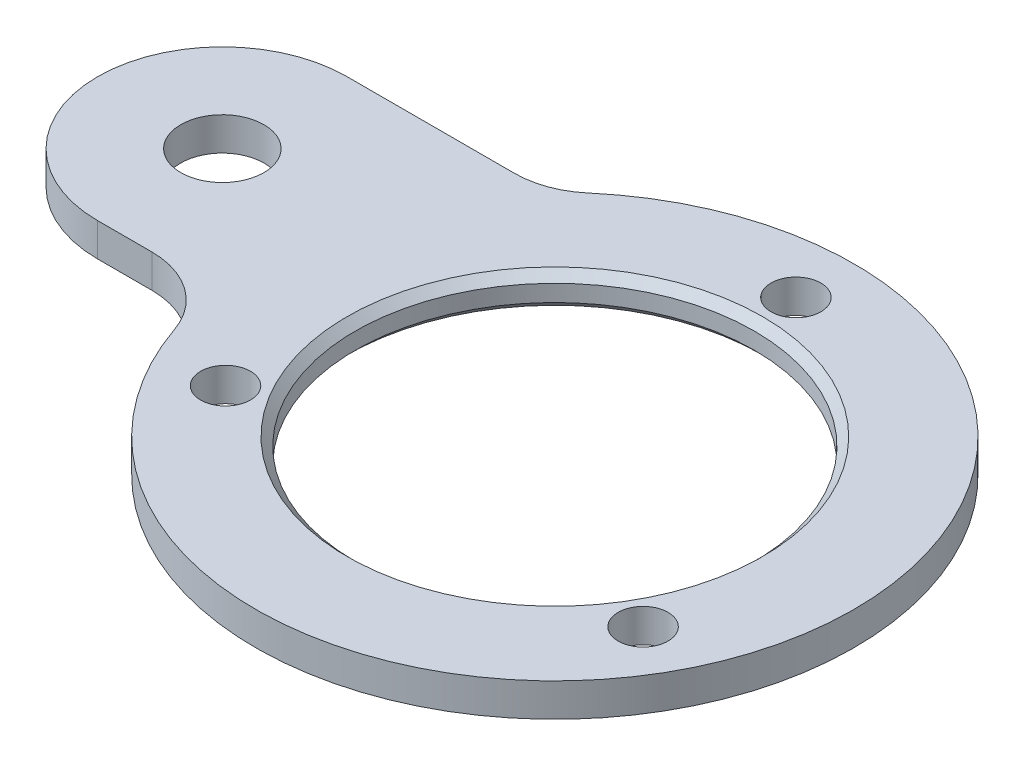
ISO-10303-21;
HEADER;
FILE_DESCRIPTION(('STEP AP214'),'2;1');
FILE_NAME('part.step','',(''),(''),'','','');
FILE_SCHEMA(('AUTOMOTIVE_DESIGN { 1 0 10303 214 1 1 1 1 }'));
ENDSEC;
DATA;
#1=APPLICATION_CONTEXT('core data for automotive mechanical design processes');
#2=APPLICATION_PROTOCOL_DEFINITION('international standard','automotive_design',2000,#1);
#3=PRODUCT_CONTEXT('',#1,'mechanical');
#4=PRODUCT('Part','Part','',(#3));
#5=PRODUCT_RELATED_PRODUCT_CATEGORY('part','',(#4));
#6=PRODUCT_DEFINITION_FORMATION('','',#4);
#7=PRODUCT_DEFINITION_CONTEXT('part definition',#1,'design');
#8=PRODUCT_DEFINITION('design','',#6,#7);
#9=PRODUCT_DEFINITION_SHAPE('','',#8);
#10=(LENGTH_UNIT() NAMED_UNIT(*) SI_UNIT(.MILLI.,.METRE.));
#11=(NAMED_UNIT(*) PLANE_ANGLE_UNIT() SI_UNIT($,.RADIAN.));
#12=(NAMED_UNIT(*) SI_UNIT($,.STERADIAN.) SOLID_ANGLE_UNIT());
#13=UNCERTAINTY_MEASURE_WITH_UNIT(LENGTH_MEASURE(1.E-05),#10,'distance_accuracy_value','');
#14=(GEOMETRIC_REPRESENTATION_CONTEXT(3) GLOBAL_UNCERTAINTY_ASSIGNED_CONTEXT((#13)) GLOBAL_UNIT_ASSIGNED_CONTEXT((#10,
#11,#12)) REPRESENTATION_CONTEXT('',''));
#15=CARTESIAN_POINT('',(0.,0.,0.));
#16=DIRECTION('',(0.,0.,1.));
#17=DIRECTION('',(1.,0.,0.));
#18=AXIS2_PLACEMENT_3D('',#15,#16,#17);
#19=CARTESIAN_POINT('',(-14.9248115565993,2.,-17.5));
#20=DIRECTION('',(0.,-1.,0.));
#21=DIRECTION('',(0.,0.,-1.));
#22=AXIS2_PLACEMENT_3D('',#19,#20,#21);
#23=PLANE('',#22);
#24=CARTESIAN_POINT('',(0.,2.,0.));
#25=DIRECTION('',(0.,-1.,0.));
#26=DIRECTION('',(0.,0.,-1.));
#27=AXIS2_PLACEMENT_3D('',#24,#25,#26);
#28=CIRCLE('',#27,12.5);
#29=CARTESIAN_POINT('',(0.,2.,-12.5));
#30=VERTEX_POINT('',#29);
#31=EDGE_CURVE('E39',#30,#30,#28,.T.);
#32=ORIENTED_EDGE('',*,*,#31,.T.);
#33=EDGE_LOOP('',(#32));
#34=FACE_BOUND('',#33,.T.);
#35=CARTESIAN_POINT('',(0.,2.,-14.5));
#36=DIRECTION('',(0.,1.,0.));
#37=DIRECTION('',(0.,0.,1.));
#38=AXIS2_PLACEMENT_3D('',#35,#36,#37);
#39=CIRCLE('',#38,1.5);
#40=CARTESIAN_POINT('',(0.,2.,-13.));
#41=VERTEX_POINT('',#40);
#42=EDGE_CURVE('E192',#41,#41,#39,.T.);
#43=ORIENTED_EDGE('',*,*,#42,.F.);
#44=EDGE_LOOP('',(#43));
#45=FACE_BOUND('',#44,.T.);
#46=CARTESIAN_POINT('',(-12.5573683548744,2.,7.24999999999989));
#47=DIRECTION('',(0.,1.,0.));
#48=DIRECTION('',(0.,0.,1.));
#49=AXIS2_PLACEMENT_3D('',#46,#47,#48);
#50=CIRCLE('',#49,1.5);
#51=CARTESIAN_POINT('',(-12.5573683548744,2.,8.74999999999989));
#52=VERTEX_POINT('',#51);
#53=EDGE_CURVE('E120',#52,#52,#50,.T.);
#54=ORIENTED_EDGE('',*,*,#53,.F.);
#55=EDGE_LOOP('',(#54));
#56=FACE_BOUND('',#55,.T.);
#57=CARTESIAN_POINT('',(-14.9248115565993,2.,-17.5));
#58=DIRECTION('',(0.,-1.,0.));
#59=DIRECTION('',(0.,0.,-1.));
#60=AXIS2_PLACEMENT_3D('',#57,#58,#59);
#61=CIRCLE('',#60,5.);
#62=CARTESIAN_POINT('',(-11.6802873051647,2.,-13.695652173913));
#63=VERTEX_POINT('',#62);
#64=CARTESIAN_POINT('',(-14.9248115565993,2.,-12.5));
#65=VERTEX_POINT('',#64);
#66=EDGE_CURVE('E127',#63,#65,#61,.T.);
#67=ORIENTED_EDGE('',*,*,#66,.T.);
#68=DIRECTION('',(-1.,0.,0.));
#69=VECTOR('',#68,1.);
#70=CARTESIAN_POINT('',(-25.,2.,-12.5));
#71=LINE('',#70,#69);
#72=CARTESIAN_POINT('',(-25.,2.,-12.5));
#73=VERTEX_POINT('',#72);
#74=EDGE_CURVE('E85',#65,#73,#71,.T.);
#75=ORIENTED_EDGE('',*,*,#74,.T.);
#76=CARTESIAN_POINT('',(-25.,2.,-5.));
#77=DIRECTION('',(0.,1.,0.));
#78=DIRECTION('',(0.,0.,-1.));
#79=AXIS2_PLACEMENT_3D('',#76,#77,#78);
#80=CIRCLE('',#79,7.5);
#81=CARTESIAN_POINT('',(-25.,2.,2.5));
#82=VERTEX_POINT('',#81);
#83=EDGE_CURVE('E98',#73,#82,#80,.T.);
#84=ORIENTED_EDGE('',*,*,#83,.T.);
#85=DIRECTION('',(1.,0.,0.));
#86=VECTOR('',#85,1.);
#87=CARTESIAN_POINT('',(-25.,2.,2.5));
#88=LINE('',#87,#86);
#89=CARTESIAN_POINT('',(-21.7428149051589,2.,2.5));
#90=VERTEX_POINT('',#89);
#91=EDGE_CURVE('E92',#82,#90,#88,.T.);
#92=ORIENTED_EDGE('',*,*,#91,.T.);
#93=CARTESIAN_POINT('',(-21.7428149051589,2.,7.5));
#94=DIRECTION('',(0.,-1.,0.));
#95=DIRECTION('',(0.,0.,1.));
#96=AXIS2_PLACEMENT_3D('',#93,#94,#95);
#97=CIRCLE('',#96,5.);
#98=CARTESIAN_POINT('',(-17.0161160127331,2.,5.86956521739131));
#99=VERTEX_POINT('',#98);
#100=EDGE_CURVE('E96',#90,#99,#97,.T.);
#101=ORIENTED_EDGE('',*,*,#100,.T.);
#102=CARTESIAN_POINT('',(0.,2.,0.));
#103=DIRECTION('',(0.,1.,0.));
#104=DIRECTION('',(0.,0.,1.));
#105=AXIS2_PLACEMENT_3D('',#102,#103,#104);
#106=CIRCLE('',#105,18.);
#107=EDGE_CURVE('E47',#99,#63,#106,.T.);
#108=ORIENTED_EDGE('',*,*,#107,.T.);
#109=EDGE_LOOP('',(#67,#75,#84,#92,#101,#108));
#110=FACE_BOUND('',#109,.T.);
#111=CARTESIAN_POINT('',(12.5573683548744,2.,7.24999999999994));
#112=DIRECTION('',(0.,1.,0.));
#113=DIRECTION('',(0.,0.,1.));
#114=AXIS2_PLACEMENT_3D('',#111,#112,#113);
#115=CIRCLE('',#114,1.4999999999999);
#116=CARTESIAN_POINT('',(12.5573683548744,2.,8.74999999999984));
#117=VERTEX_POINT('',#116);
#118=EDGE_CURVE('E196',#117,#117,#115,.T.);
#119=ORIENTED_EDGE('',*,*,#118,.F.);
#120=EDGE_LOOP('',(#119));
#121=FACE_BOUND('',#120,.T.);
#122=CARTESIAN_POINT('',(-25.,2.,-5.));
#123=DIRECTION('',(0.,1.,0.));
#124=DIRECTION('',(0.,0.,-1.));
#125=AXIS2_PLACEMENT_3D('',#122,#123,#124);
#126=CIRCLE('',#125,2.5);
#127=CARTESIAN_POINT('',(-25.,2.,-7.5));
#128=VERTEX_POINT('',#127);
#129=EDGE_CURVE('E187',#128,#128,#126,.T.);
#130=ORIENTED_EDGE('',*,*,#129,.F.);
#131=EDGE_LOOP('',(#130));
#132=FACE_BOUND('',#131,.T.);
#133=ADVANCED_FACE('F30',(#34,#45,#56,#110,#121,#132),#23,.F.);
#134=CARTESIAN_POINT('',(-14.9248115565993,0.,-17.5));
#135=DIRECTION('',(0.,-1.,0.));
#136=DIRECTION('',(0.,0.,-1.));
#137=AXIS2_PLACEMENT_3D('',#134,#135,#136);
#138=PLANE('',#137);
#139=CARTESIAN_POINT('',(0.,0.,0.));
#140=DIRECTION('',(0.,-1.,0.));
#141=DIRECTION('',(0.,0.,-1.));
#142=AXIS2_PLACEMENT_3D('',#139,#140,#141);
#143=CIRCLE('',#142,12.5);
#144=CARTESIAN_POINT('',(0.,0.,-12.5));
#145=VERTEX_POINT('',#144);
#146=EDGE_CURVE('E11',#145,#145,#143,.F.);
#147=ORIENTED_EDGE('',*,*,#146,.T.);
#148=EDGE_LOOP('',(#147));
#149=FACE_BOUND('',#148,.T.);
#150=CARTESIAN_POINT('',(0.,0.,-14.5));
#151=DIRECTION('',(0.,1.,0.));
#152=DIRECTION('',(0.,0.,1.));
#153=AXIS2_PLACEMENT_3D('',#150,#151,#152);
#154=CIRCLE('',#153,1.5);
#155=CARTESIAN_POINT('',(0.,0.,-13.));
#156=VERTEX_POINT('',#155);
#157=EDGE_CURVE('E172',#156,#156,#154,.T.);
#158=ORIENTED_EDGE('',*,*,#157,.T.);
#159=EDGE_LOOP('',(#158));
#160=FACE_BOUND('',#159,.T.);
#161=CARTESIAN_POINT('',(-12.5573683548744,0.,7.24999999999989));
#162=DIRECTION('',(0.,1.,0.));
#163=DIRECTION('',(0.,0.,1.));
#164=AXIS2_PLACEMENT_3D('',#161,#162,#163);
#165=CIRCLE('',#164,1.5);
#166=CARTESIAN_POINT('',(-12.5573683548744,0.,8.74999999999989));
#167=VERTEX_POINT('',#166);
#168=EDGE_CURVE('E176',#167,#167,#165,.T.);
#169=ORIENTED_EDGE('',*,*,#168,.T.);
#170=EDGE_LOOP('',(#169));
#171=FACE_BOUND('',#170,.T.);
#172=CARTESIAN_POINT('',(-14.9248115565993,0.,-17.5));
#173=DIRECTION('',(0.,-1.,0.));
#174=DIRECTION('',(0.,0.,-1.));
#175=AXIS2_PLACEMENT_3D('',#172,#173,#174);
#176=CIRCLE('',#175,5.);
#177=CARTESIAN_POINT('',(-11.6802873051647,0.,-13.695652173913));
#178=VERTEX_POINT('',#177);
#179=CARTESIAN_POINT('',(-14.9248115565993,0.,-12.5));
#180=VERTEX_POINT('',#179);
#181=EDGE_CURVE('E116',#178,#180,#176,.T.);
#182=ORIENTED_EDGE('',*,*,#181,.F.);
#183=CARTESIAN_POINT('',(0.,0.,0.));
#184=DIRECTION('',(0.,1.,0.));
#185=DIRECTION('',(0.,0.,1.));
#186=AXIS2_PLACEMENT_3D('',#183,#184,#185);
#187=CIRCLE('',#186,18.);
#188=CARTESIAN_POINT('',(-17.0161160127331,0.,5.86956521739131));
#189=VERTEX_POINT('',#188);
#190=EDGE_CURVE('E76',#189,#178,#187,.T.);
#191=ORIENTED_EDGE('',*,*,#190,.F.);
#192=CARTESIAN_POINT('',(-21.7428149051589,0.,7.5));
#193=DIRECTION('',(0.,-1.,0.));
#194=DIRECTION('',(0.,0.,1.));
#195=AXIS2_PLACEMENT_3D('',#192,#193,#194);
#196=CIRCLE('',#195,5.);
#197=CARTESIAN_POINT('',(-21.7428149051589,0.,2.5));
#198=VERTEX_POINT('',#197);
#199=EDGE_CURVE('E70',#198,#189,#196,.T.);
#200=ORIENTED_EDGE('',*,*,#199,.F.);
#201=DIRECTION('',(1.,0.,0.));
#202=VECTOR('',#201,1.);
#203=CARTESIAN_POINT('',(-25.,0.,2.5));
#204=LINE('',#203,#202);
#205=CARTESIAN_POINT('',(-25.,0.,2.5));
#206=VERTEX_POINT('',#205);
#207=EDGE_CURVE('E106',#206,#198,#204,.T.);
#208=ORIENTED_EDGE('',*,*,#207,.F.);
#209=CARTESIAN_POINT('',(-25.,0.,-5.));
#210=DIRECTION('',(0.,1.,0.));
#211=DIRECTION('',(0.,0.,-1.));
#212=AXIS2_PLACEMENT_3D('',#209,#210,#211);
#213=CIRCLE('',#212,7.5);
#214=CARTESIAN_POINT('',(-25.,0.,-12.5));
#215=VERTEX_POINT('',#214);
#216=EDGE_CURVE('E122',#215,#206,#213,.T.);
#217=ORIENTED_EDGE('',*,*,#216,.F.);
#218=DIRECTION('',(-1.,0.,0.));
#219=VECTOR('',#218,1.);
#220=CARTESIAN_POINT('',(-25.,0.,-12.5));
#221=LINE('',#220,#219);
#222=EDGE_CURVE('E119',#180,#215,#221,.T.);
#223=ORIENTED_EDGE('',*,*,#222,.F.);
#224=EDGE_LOOP('',(#182,#191,#200,#208,#217,#223));
#225=FACE_BOUND('',#224,.T.);
#226=CARTESIAN_POINT('',(12.5573683548744,0.,7.24999999999994));
#227=DIRECTION('',(0.,1.,0.));
#228=DIRECTION('',(0.,0.,1.));
#229=AXIS2_PLACEMENT_3D('',#226,#227,#228);
#230=CIRCLE('',#229,1.4999999999999);
#231=CARTESIAN_POINT('',(12.5573683548744,0.,8.74999999999984));
#232=VERTEX_POINT('',#231);
#233=EDGE_CURVE('E182',#232,#232,#230,.T.);
#234=ORIENTED_EDGE('',*,*,#233,.T.);
#235=EDGE_LOOP('',(#234));
#236=FACE_BOUND('',#235,.T.);
#237=CARTESIAN_POINT('',(-25.,0.,-5.));
#238=DIRECTION('',(0.,1.,0.));
#239=DIRECTION('',(0.,0.,-1.));
#240=AXIS2_PLACEMENT_3D('',#237,#238,#239);
#241=CIRCLE('',#240,2.5);
#242=CARTESIAN_POINT('',(-25.,0.,-7.5));
#243=VERTEX_POINT('',#242);
#244=EDGE_CURVE('E185',#243,#243,#241,.T.);
#245=ORIENTED_EDGE('',*,*,#244,.T.);
#246=EDGE_LOOP('',(#245));
#247=FACE_BOUND('',#246,.T.);
#248=ADVANCED_FACE('F164',(#149,#160,#171,#225,#236,#247),#138,.T.);
#249=CARTESIAN_POINT('',(-14.9248115565993,2.,-17.5));
#250=DIRECTION('',(0.,-1.,0.));
#251=DIRECTION('',(0.,0.,-1.));
#252=AXIS2_PLACEMENT_3D('',#249,#250,#251);
#253=CYLINDRICAL_SURFACE('',#252,5.);
#254=ORIENTED_EDGE('',*,*,#181,.T.);
#255=DIRECTION('',(0.,-1.,0.));
#256=VECTOR('',#255,1.);
#257=CARTESIAN_POINT('',(-14.9248115565993,2.,-12.5));
#258=LINE('',#257,#256);
#259=EDGE_CURVE('E134',#65,#180,#258,.T.);
#260=ORIENTED_EDGE('',*,*,#259,.F.);
#261=ORIENTED_EDGE('',*,*,#66,.F.);
#262=DIRECTION('',(0.,-1.,0.));
#263=VECTOR('',#262,1.);
#264=CARTESIAN_POINT('',(-11.6802873051647,2.,-13.695652173913));
#265=LINE('',#264,#263);
#266=EDGE_CURVE('E112',#63,#178,#265,.T.);
#267=ORIENTED_EDGE('',*,*,#266,.T.);
#268=EDGE_LOOP('',(#254,#260,#261,#267));
#269=FACE_BOUND('',#268,.T.);
#270=ADVANCED_FACE('F167',(#269),#253,.F.);
#271=CARTESIAN_POINT('',(-25.,2.,-12.5));
#272=DIRECTION('',(0.,0.,1.));
#273=DIRECTION('',(1.,0.,0.));
#274=AXIS2_PLACEMENT_3D('',#271,#272,#273);
#275=PLANE('',#274);
#276=ORIENTED_EDGE('',*,*,#222,.T.);
#277=DIRECTION('',(0.,-1.,0.));
#278=VECTOR('',#277,1.);
#279=CARTESIAN_POINT('',(-25.,2.,-12.5));
#280=LINE('',#279,#278);
#281=EDGE_CURVE('E131',#73,#215,#280,.T.);
#282=ORIENTED_EDGE('',*,*,#281,.F.);
#283=ORIENTED_EDGE('',*,*,#74,.F.);
#284=ORIENTED_EDGE('',*,*,#259,.T.);
#285=EDGE_LOOP('',(#276,#282,#283,#284));
#286=FACE_BOUND('',#285,.T.);
#287=ADVANCED_FACE('F206',(#286),#275,.F.);
#288=CARTESIAN_POINT('',(-25.,2.,-5.));
#289=DIRECTION('',(0.,-1.,0.));
#290=DIRECTION('',(0.,0.,-1.));
#291=AXIS2_PLACEMENT_3D('',#288,#289,#290);
#292=CYLINDRICAL_SURFACE('',#291,7.5);
#293=ORIENTED_EDGE('',*,*,#216,.T.);
#294=DIRECTION('',(0.,-1.,0.));
#295=VECTOR('',#294,1.);
#296=CARTESIAN_POINT('',(-25.,2.,2.5));
#297=LINE('',#296,#295);
#298=EDGE_CURVE('E107',#82,#206,#297,.T.);
#299=ORIENTED_EDGE('',*,*,#298,.F.);
#300=ORIENTED_EDGE('',*,*,#83,.F.);
#301=ORIENTED_EDGE('',*,*,#281,.T.);
#302=EDGE_LOOP('',(#293,#299,#300,#301));
#303=FACE_BOUND('',#302,.T.);
#304=ADVANCED_FACE('F209',(#303),#292,.T.);
#305=CARTESIAN_POINT('',(-25.,2.,2.5));
#306=DIRECTION('',(0.,0.,-1.));
#307=DIRECTION('',(-1.,0.,0.));
#308=AXIS2_PLACEMENT_3D('',#305,#306,#307);
#309=PLANE('',#308);
#310=ORIENTED_EDGE('',*,*,#207,.T.);
#311=DIRECTION('',(0.,-1.,0.));
#312=VECTOR('',#311,1.);
#313=CARTESIAN_POINT('',(-21.7428149051589,2.,2.5));
#314=LINE('',#313,#312);
#315=EDGE_CURVE('E103',#90,#198,#314,.T.);
#316=ORIENTED_EDGE('',*,*,#315,.F.);
#317=ORIENTED_EDGE('',*,*,#91,.F.);
#318=ORIENTED_EDGE('',*,*,#298,.T.);
#319=EDGE_LOOP('',(#310,#316,#317,#318));
#320=FACE_BOUND('',#319,.T.);
#321=ADVANCED_FACE('F104',(#320),#309,.F.);
#322=CARTESIAN_POINT('',(-21.7428149051589,2.,7.5));
#323=DIRECTION('',(0.,-1.,0.));
#324=DIRECTION('',(0.,0.,-1.));
#325=AXIS2_PLACEMENT_3D('',#322,#323,#324);
#326=CYLINDRICAL_SURFACE('',#325,5.);
#327=ORIENTED_EDGE('',*,*,#199,.T.);
#328=DIRECTION('',(0.,-1.,0.));
#329=VECTOR('',#328,1.);
#330=CARTESIAN_POINT('',(-17.0161160127331,2.,5.86956521739131));
#331=LINE('',#330,#329);
#332=EDGE_CURVE('E108',#99,#189,#331,.T.);
#333=ORIENTED_EDGE('',*,*,#332,.F.);
#334=ORIENTED_EDGE('',*,*,#100,.F.);
#335=ORIENTED_EDGE('',*,*,#315,.T.);
#336=EDGE_LOOP('',(#327,#333,#334,#335));
#337=FACE_BOUND('',#336,.T.);
#338=ADVANCED_FACE('F110',(#337),#326,.F.);
#339=CARTESIAN_POINT('',(0.,2.,0.));
#340=DIRECTION('',(0.,-1.,0.));
#341=DIRECTION('',(0.,0.,-1.));
#342=AXIS2_PLACEMENT_3D('',#339,#340,#341);
#343=CYLINDRICAL_SURFACE('',#342,18.);
#344=ORIENTED_EDGE('',*,*,#190,.T.);
#345=ORIENTED_EDGE('',*,*,#266,.F.);
#346=ORIENTED_EDGE('',*,*,#107,.F.);
#347=ORIENTED_EDGE('',*,*,#332,.T.);
#348=EDGE_LOOP('',(#344,#345,#346,#347));
#349=FACE_BOUND('',#348,.T.);
#350=ADVANCED_FACE('F156',(#349),#343,.T.);
#351=CARTESIAN_POINT('',(0.,2.,0.));
#352=DIRECTION('',(0.,-1.,0.));
#353=DIRECTION('',(0.,0.,-1.));
#354=AXIS2_PLACEMENT_3D('',#351,#352,#353);
#355=CYLINDRICAL_SURFACE('',#354,12.);
#356=CARTESIAN_POINT('',(0.,1.5,0.));
#357=DIRECTION('',(0.,-1.,0.));
#358=DIRECTION('',(0.,0.,-1.));
#359=AXIS2_PLACEMENT_3D('',#356,#357,#358);
#360=CIRCLE('',#359,12.);
#361=CARTESIAN_POINT('',(0.,1.5,-12.));
#362=VERTEX_POINT('',#361);
#363=EDGE_CURVE('E139',#362,#362,#360,.F.);
#364=ORIENTED_EDGE('',*,*,#363,.T.);
#365=EDGE_LOOP('',(#364));
#366=FACE_BOUND('',#365,.T.);
#367=CARTESIAN_POINT('',(0.,0.499999999999995,0.));
#368=DIRECTION('',(0.,-1.,0.));
#369=DIRECTION('',(0.,0.,-1.));
#370=AXIS2_PLACEMENT_3D('',#367,#368,#369);
#371=CIRCLE('',#370,12.);
#372=CARTESIAN_POINT('',(0.,0.499999999999995,-12.));
#373=VERTEX_POINT('',#372);
#374=EDGE_CURVE('E136',#373,#373,#371,.T.);
#375=ORIENTED_EDGE('',*,*,#374,.T.);
#376=EDGE_LOOP('',(#375));
#377=FACE_BOUND('',#376,.T.);
#378=ADVANCED_FACE('F152',(#366,#377),#355,.F.);
#379=CARTESIAN_POINT('',(-12.5573683548744,2.,7.24999999999989));
#380=DIRECTION('',(0.,-1.,0.));
#381=DIRECTION('',(0.,0.,-1.));
#382=AXIS2_PLACEMENT_3D('',#379,#380,#381);
#383=CYLINDRICAL_SURFACE('',#382,1.5);
#384=ORIENTED_EDGE('',*,*,#53,.T.);
#385=EDGE_LOOP('',(#384));
#386=FACE_BOUND('',#385,.T.);
#387=ORIENTED_EDGE('',*,*,#168,.F.);
#388=EDGE_LOOP('',(#387));
#389=FACE_BOUND('',#388,.T.);
#390=ADVANCED_FACE('F155',(#386,#389),#383,.F.);
#391=CARTESIAN_POINT('',(12.5573683548744,2.,7.24999999999994));
#392=DIRECTION('',(0.,-1.,0.));
#393=DIRECTION('',(0.,0.,-1.));
#394=AXIS2_PLACEMENT_3D('',#391,#392,#393);
#395=CYLINDRICAL_SURFACE('',#394,1.4999999999999);
#396=ORIENTED_EDGE('',*,*,#118,.T.);
#397=EDGE_LOOP('',(#396));
#398=FACE_BOUND('',#397,.T.);
#399=ORIENTED_EDGE('',*,*,#233,.F.);
#400=EDGE_LOOP('',(#399));
#401=FACE_BOUND('',#400,.T.);
#402=ADVANCED_FACE('F224',(#398,#401),#395,.F.);
#403=CARTESIAN_POINT('',(0.,2.,-14.5));
#404=DIRECTION('',(0.,-1.,0.));
#405=DIRECTION('',(0.,0.,-1.));
#406=AXIS2_PLACEMENT_3D('',#403,#404,#405);
#407=CYLINDRICAL_SURFACE('',#406,1.5);
#408=ORIENTED_EDGE('',*,*,#42,.T.);
#409=EDGE_LOOP('',(#408));
#410=FACE_BOUND('',#409,.T.);
#411=ORIENTED_EDGE('',*,*,#157,.F.);
#412=EDGE_LOOP('',(#411));
#413=FACE_BOUND('',#412,.T.);
#414=ADVANCED_FACE('F228',(#410,#413),#407,.F.);
#415=CARTESIAN_POINT('',(-25.,2.,-5.));
#416=DIRECTION('',(0.,-1.,0.));
#417=DIRECTION('',(0.,0.,-1.));
#418=AXIS2_PLACEMENT_3D('',#415,#416,#417);
#419=CYLINDRICAL_SURFACE('',#418,2.5);
#420=ORIENTED_EDGE('',*,*,#129,.T.);
#421=EDGE_LOOP('',(#420));
#422=FACE_BOUND('',#421,.T.);
#423=ORIENTED_EDGE('',*,*,#244,.F.);
#424=EDGE_LOOP('',(#423));
#425=FACE_BOUND('',#424,.T.);
#426=ADVANCED_FACE('F149',(#422,#425),#419,.F.);
#427=CARTESIAN_POINT('',(0.,1.5,0.));
#428=DIRECTION('',(0.,1.,0.));
#429=DIRECTION('',(0.,0.,1.));
#430=AXIS2_PLACEMENT_3D('',#427,#428,#429);
#431=CONICAL_SURFACE('',#430,12.,0.785398163397457);
#432=ORIENTED_EDGE('',*,*,#31,.F.);
#433=EDGE_LOOP('',(#432));
#434=FACE_BOUND('',#433,.T.);
#435=ORIENTED_EDGE('',*,*,#363,.F.);
#436=EDGE_LOOP('',(#435));
#437=FACE_BOUND('',#436,.T.);
#438=ADVANCED_FACE('F146',(#434,#437),#431,.F.);
#439=CARTESIAN_POINT('',(0.,0.,0.));
#440=DIRECTION('',(0.,-1.,0.));
#441=DIRECTION('',(0.,0.,-1.));
#442=AXIS2_PLACEMENT_3D('',#439,#440,#441);
#443=CONICAL_SURFACE('',#442,12.5,0.785398163397448);
#444=ORIENTED_EDGE('',*,*,#374,.F.);
#445=EDGE_LOOP('',(#444));
#446=FACE_BOUND('',#445,.T.);
#447=ORIENTED_EDGE('',*,*,#146,.F.);
#448=EDGE_LOOP('',(#447));
#449=FACE_BOUND('',#448,.T.);
#450=ADVANCED_FACE('F32',(#446,#449),#443,.F.);
#451=CLOSED_SHELL('',(#133,#248,#270,#287,#304,#321,#338,#350,#378,#390,#402,#414,#426,#438,#450));
#452=MANIFOLD_SOLID_BREP('B2',#451);
#453=ADVANCED_BREP_SHAPE_REPRESENTATION('',(#18,#452),#14);
#454=SHAPE_DEFINITION_REPRESENTATION(#9,#453);
ENDSEC;
END-ISO-10303-21;
